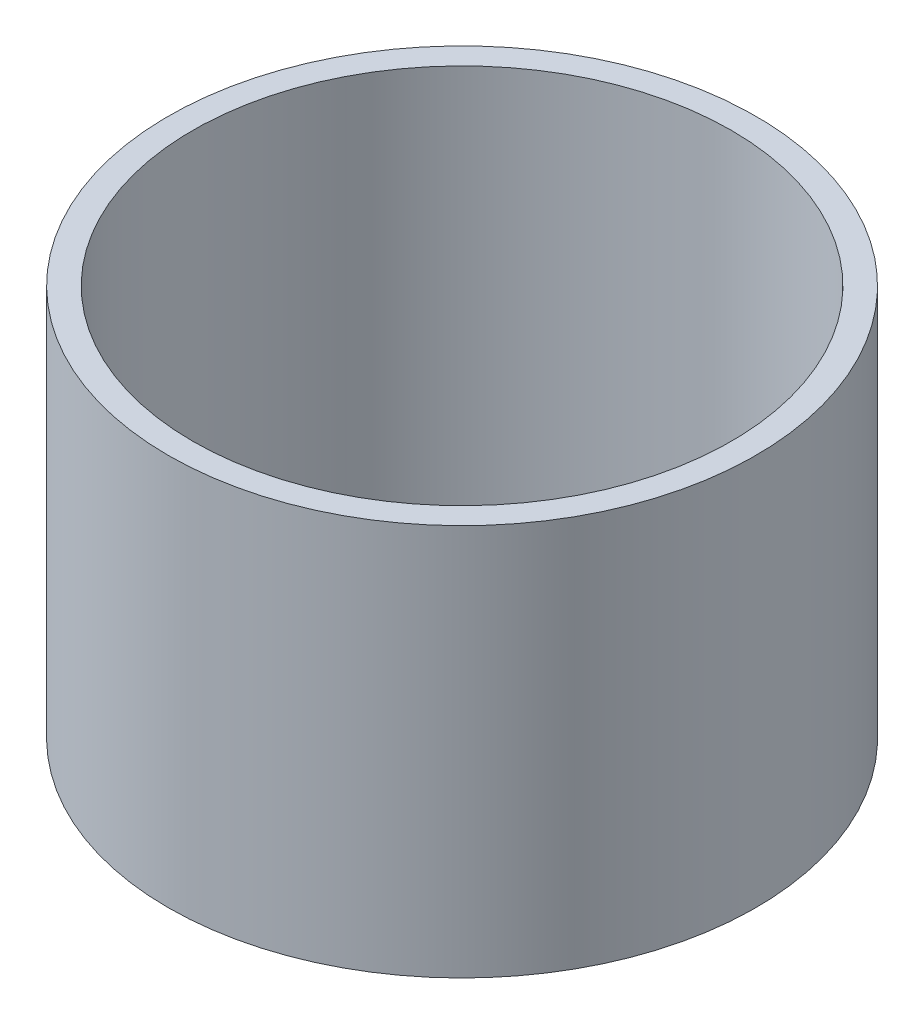
ISO-10303-21;
HEADER;
FILE_DESCRIPTION(('STEP AP214'),'2;1');
FILE_NAME('part.step','',(''),(''),'','','');
FILE_SCHEMA(('AUTOMOTIVE_DESIGN { 1 0 10303 214 1 1 1 1 }'));
ENDSEC;
DATA;
#1=APPLICATION_CONTEXT('core data for automotive mechanical design processes');
#2=APPLICATION_PROTOCOL_DEFINITION('international standard','automotive_design',2000,#1);
#3=PRODUCT_CONTEXT('',#1,'mechanical');
#4=PRODUCT('Part','Part','',(#3));
#5=PRODUCT_RELATED_PRODUCT_CATEGORY('part','',(#4));
#6=PRODUCT_DEFINITION_FORMATION('','',#4);
#7=PRODUCT_DEFINITION_CONTEXT('part definition',#1,'design');
#8=PRODUCT_DEFINITION('design','',#6,#7);
#9=PRODUCT_DEFINITION_SHAPE('','',#8);
#10=(LENGTH_UNIT() NAMED_UNIT(*) SI_UNIT(.MILLI.,.METRE.));
#11=(NAMED_UNIT(*) PLANE_ANGLE_UNIT() SI_UNIT($,.RADIAN.));
#12=(NAMED_UNIT(*) SI_UNIT($,.STERADIAN.) SOLID_ANGLE_UNIT());
#13=UNCERTAINTY_MEASURE_WITH_UNIT(LENGTH_MEASURE(1.E-05),#10,'distance_accuracy_value','');
#14=(GEOMETRIC_REPRESENTATION_CONTEXT(3) GLOBAL_UNCERTAINTY_ASSIGNED_CONTEXT((#13)) GLOBAL_UNIT_ASSIGNED_CONTEXT((#10,
#11,#12)) REPRESENTATION_CONTEXT('',''));
#15=CARTESIAN_POINT('',(0.,0.,0.));
#16=DIRECTION('',(0.,0.,1.));
#17=DIRECTION('',(1.,0.,0.));
#18=AXIS2_PLACEMENT_3D('',#15,#16,#17);
#19=CARTESIAN_POINT('',(0.,80.,0.));
#20=DIRECTION('',(0.,1.,0.));
#21=DIRECTION('',(0.,0.,1.));
#22=AXIS2_PLACEMENT_3D('',#19,#20,#21);
#23=PLANE('',#22);
#24=CARTESIAN_POINT('',(0.,80.,0.));
#25=DIRECTION('',(0.,1.,0.));
#26=DIRECTION('',(0.,0.,1.));
#27=AXIS2_PLACEMENT_3D('',#24,#25,#26);
#28=CIRCLE('',#27,60.);
#29=CARTESIAN_POINT('',(0.,80.,60.));
#30=VERTEX_POINT('',#29);
#31=EDGE_CURVE('E10',#30,#30,#28,.T.);
#32=ORIENTED_EDGE('',*,*,#31,.T.);
#33=EDGE_LOOP('',(#32));
#34=FACE_BOUND('',#33,.T.);
#35=CARTESIAN_POINT('',(0.,80.,0.));
#36=DIRECTION('',(0.,1.,0.));
#37=DIRECTION('',(0.,0.,1.));
#38=AXIS2_PLACEMENT_3D('',#35,#36,#37);
#39=CIRCLE('',#38,55.);
#40=CARTESIAN_POINT('',(0.,80.,55.));
#41=VERTEX_POINT('',#40);
#42=EDGE_CURVE('E41',#41,#41,#39,.T.);
#43=ORIENTED_EDGE('',*,*,#42,.F.);
#44=EDGE_LOOP('',(#43));
#45=FACE_BOUND('',#44,.T.);
#46=ADVANCED_FACE('F30',(#34,#45),#23,.T.);
#47=CARTESIAN_POINT('',(0.,0.,0.));
#48=DIRECTION('',(0.,1.,0.));
#49=DIRECTION('',(0.,0.,1.));
#50=AXIS2_PLACEMENT_3D('',#47,#48,#49);
#51=PLANE('',#50);
#52=CARTESIAN_POINT('',(0.,0.,0.));
#53=DIRECTION('',(0.,1.,0.));
#54=DIRECTION('',(0.,0.,1.));
#55=AXIS2_PLACEMENT_3D('',#52,#53,#54);
#56=CIRCLE('',#55,60.);
#57=CARTESIAN_POINT('',(0.,0.,60.));
#58=VERTEX_POINT('',#57);
#59=EDGE_CURVE('E34',#58,#58,#56,.T.);
#60=ORIENTED_EDGE('',*,*,#59,.F.);
#61=EDGE_LOOP('',(#60));
#62=FACE_BOUND('',#61,.T.);
#63=CARTESIAN_POINT('',(0.,0.,0.));
#64=DIRECTION('',(0.,1.,0.));
#65=DIRECTION('',(0.,0.,1.));
#66=AXIS2_PLACEMENT_3D('',#63,#64,#65);
#67=CIRCLE('',#66,55.);
#68=CARTESIAN_POINT('',(0.,0.,55.));
#69=VERTEX_POINT('',#68);
#70=EDGE_CURVE('E43',#69,#69,#67,.T.);
#71=ORIENTED_EDGE('',*,*,#70,.T.);
#72=EDGE_LOOP('',(#71));
#73=FACE_BOUND('',#72,.T.);
#74=ADVANCED_FACE('F53',(#62,#73),#51,.F.);
#75=CARTESIAN_POINT('',(0.,80.,0.));
#76=DIRECTION('',(0.,-1.,0.));
#77=DIRECTION('',(0.,0.,-1.));
#78=AXIS2_PLACEMENT_3D('',#75,#76,#77);
#79=CYLINDRICAL_SURFACE('',#78,60.);
#80=ORIENTED_EDGE('',*,*,#31,.F.);
#81=EDGE_LOOP('',(#80));
#82=FACE_BOUND('',#81,.T.);
#83=ORIENTED_EDGE('',*,*,#59,.T.);
#84=EDGE_LOOP('',(#83));
#85=FACE_BOUND('',#84,.T.);
#86=ADVANCED_FACE('F32',(#82,#85),#79,.T.);
#87=CARTESIAN_POINT('',(0.,80.,0.));
#88=DIRECTION('',(0.,-1.,0.));
#89=DIRECTION('',(0.,0.,-1.));
#90=AXIS2_PLACEMENT_3D('',#87,#88,#89);
#91=CYLINDRICAL_SURFACE('',#90,55.);
#92=ORIENTED_EDGE('',*,*,#42,.T.);
#93=EDGE_LOOP('',(#92));
#94=FACE_BOUND('',#93,.T.);
#95=ORIENTED_EDGE('',*,*,#70,.F.);
#96=EDGE_LOOP('',(#95));
#97=FACE_BOUND('',#96,.T.);
#98=ADVANCED_FACE('F49',(#94,#97),#91,.F.);
#99=CLOSED_SHELL('',(#46,#74,#86,#98));
#100=MANIFOLD_SOLID_BREP('B2',#99);
#101=ADVANCED_BREP_SHAPE_REPRESENTATION('',(#18,#100),#14);
#102=SHAPE_DEFINITION_REPRESENTATION(#9,#101);
ENDSEC;
END-ISO-10303-21;
